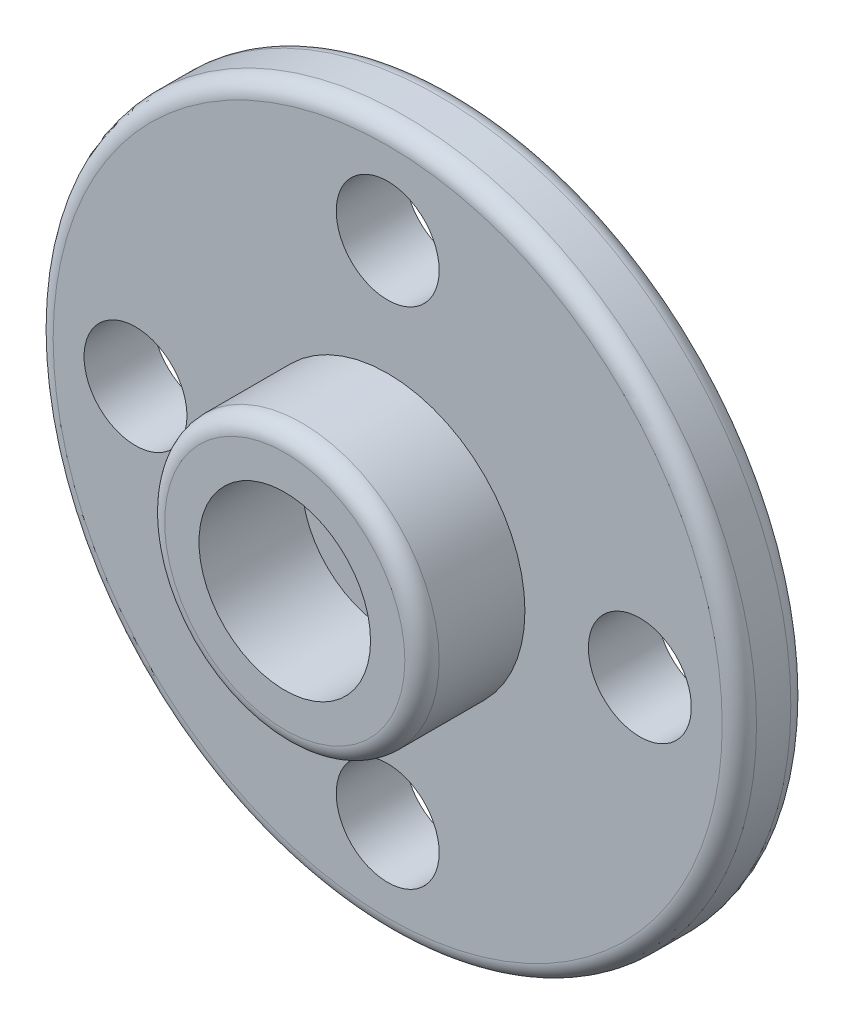
ISO-10303-21;
HEADER;
FILE_DESCRIPTION(('STEP AP214'),'2;1');
FILE_NAME('part.step','',(''),(''),'','','');
FILE_SCHEMA(('AUTOMOTIVE_DESIGN { 1 0 10303 214 1 1 1 1 }'));
ENDSEC;
DATA;
#1=APPLICATION_CONTEXT('core data for automotive mechanical design processes');
#2=APPLICATION_PROTOCOL_DEFINITION('international standard','automotive_design',2000,#1);
#3=PRODUCT_CONTEXT('',#1,'mechanical');
#4=PRODUCT('Part','Part','',(#3));
#5=PRODUCT_RELATED_PRODUCT_CATEGORY('part','',(#4));
#6=PRODUCT_DEFINITION_FORMATION('','',#4);
#7=PRODUCT_DEFINITION_CONTEXT('part definition',#1,'design');
#8=PRODUCT_DEFINITION('design','',#6,#7);
#9=PRODUCT_DEFINITION_SHAPE('','',#8);
#10=(LENGTH_UNIT() NAMED_UNIT(*) SI_UNIT(.MILLI.,.METRE.));
#11=(NAMED_UNIT(*) PLANE_ANGLE_UNIT() SI_UNIT($,.RADIAN.));
#12=(NAMED_UNIT(*) SI_UNIT($,.STERADIAN.) SOLID_ANGLE_UNIT());
#13=UNCERTAINTY_MEASURE_WITH_UNIT(LENGTH_MEASURE(1.E-05),#10,'distance_accuracy_value','');
#14=(GEOMETRIC_REPRESENTATION_CONTEXT(3) GLOBAL_UNCERTAINTY_ASSIGNED_CONTEXT((#13)) GLOBAL_UNIT_ASSIGNED_CONTEXT((#10,
#11,#12)) REPRESENTATION_CONTEXT('',''));
#15=CARTESIAN_POINT('',(0.,0.,0.));
#16=DIRECTION('',(0.,0.,1.));
#17=DIRECTION('',(1.,0.,0.));
#18=AXIS2_PLACEMENT_3D('',#15,#16,#17);
#19=CARTESIAN_POINT('',(0.,0.,4.5));
#20=DIRECTION('',(0.,0.,1.));
#21=DIRECTION('',(1.,0.,0.));
#22=AXIS2_PLACEMENT_3D('',#19,#20,#21);
#23=TOROIDAL_SURFACE('',#22,3.5,0.5);
#24=CARTESIAN_POINT('',(0.,0.,5.));
#25=DIRECTION('',(0.,0.,1.));
#26=DIRECTION('',(1.,0.,0.));
#27=AXIS2_PLACEMENT_3D('',#24,#25,#26);
#28=CIRCLE('',#27,3.5);
#29=CARTESIAN_POINT('',(3.5,0.,5.));
#30=VERTEX_POINT('',#29);
#31=EDGE_CURVE('E66',#30,#30,#28,.T.);
#32=ORIENTED_EDGE('',*,*,#31,.F.);
#33=EDGE_LOOP('',(#32));
#34=FACE_BOUND('',#33,.T.);
#35=CARTESIAN_POINT('',(0.,0.,4.5));
#36=DIRECTION('',(0.,0.,1.));
#37=DIRECTION('',(1.,0.,0.));
#38=AXIS2_PLACEMENT_3D('',#35,#36,#37);
#39=CIRCLE('',#38,4.);
#40=CARTESIAN_POINT('',(4.,0.,4.5));
#41=VERTEX_POINT('',#40);
#42=EDGE_CURVE('E11',#41,#41,#39,.F.);
#43=ORIENTED_EDGE('',*,*,#42,.F.);
#44=EDGE_LOOP('',(#43));
#45=FACE_BOUND('',#44,.T.);
#46=ADVANCED_FACE('F60',(#34,#45),#23,.T.);
#47=CARTESIAN_POINT('',(0.,0.,0.5));
#48=DIRECTION('',(0.,0.,1.));
#49=DIRECTION('',(1.,0.,0.));
#50=AXIS2_PLACEMENT_3D('',#47,#48,#49);
#51=TOROIDAL_SURFACE('',#50,9.75,0.5);
#52=CARTESIAN_POINT('',(0.,0.,0.));
#53=DIRECTION('',(0.,0.,1.));
#54=DIRECTION('',(1.,0.,0.));
#55=AXIS2_PLACEMENT_3D('',#52,#53,#54);
#56=CIRCLE('',#55,9.75);
#57=CARTESIAN_POINT('',(9.75,0.,0.));
#58=VERTEX_POINT('',#57);
#59=EDGE_CURVE('E74',#58,#58,#56,.F.);
#60=ORIENTED_EDGE('',*,*,#59,.F.);
#61=EDGE_LOOP('',(#60));
#62=FACE_BOUND('',#61,.T.);
#63=CARTESIAN_POINT('',(0.,0.,0.5));
#64=DIRECTION('',(0.,0.,1.));
#65=DIRECTION('',(1.,0.,0.));
#66=AXIS2_PLACEMENT_3D('',#63,#64,#65);
#67=CIRCLE('',#66,10.25);
#68=CARTESIAN_POINT('',(10.25,0.,0.5));
#69=VERTEX_POINT('',#68);
#70=EDGE_CURVE('E70',#69,#69,#67,.T.);
#71=ORIENTED_EDGE('',*,*,#70,.F.);
#72=EDGE_LOOP('',(#71));
#73=FACE_BOUND('',#72,.T.);
#74=ADVANCED_FACE('F143',(#62,#73),#51,.T.);
#75=CARTESIAN_POINT('',(0.,0.,1.5));
#76=DIRECTION('',(0.,0.,1.));
#77=DIRECTION('',(1.,0.,0.));
#78=AXIS2_PLACEMENT_3D('',#75,#76,#77);
#79=TOROIDAL_SURFACE('',#78,9.75,0.5);
#80=CARTESIAN_POINT('',(0.,0.,2.));
#81=DIRECTION('',(0.,0.,1.));
#82=DIRECTION('',(1.,0.,0.));
#83=AXIS2_PLACEMENT_3D('',#80,#81,#82);
#84=CIRCLE('',#83,9.75);
#85=CARTESIAN_POINT('',(9.75,0.,2.));
#86=VERTEX_POINT('',#85);
#87=EDGE_CURVE('E82',#86,#86,#84,.T.);
#88=ORIENTED_EDGE('',*,*,#87,.F.);
#89=EDGE_LOOP('',(#88));
#90=FACE_BOUND('',#89,.T.);
#91=CARTESIAN_POINT('',(0.,0.,1.5));
#92=DIRECTION('',(0.,0.,1.));
#93=DIRECTION('',(1.,0.,0.));
#94=AXIS2_PLACEMENT_3D('',#91,#92,#93);
#95=CIRCLE('',#94,10.25);
#96=CARTESIAN_POINT('',(10.25,0.,1.5));
#97=VERTEX_POINT('',#96);
#98=EDGE_CURVE('E79',#97,#97,#95,.F.);
#99=ORIENTED_EDGE('',*,*,#98,.F.);
#100=EDGE_LOOP('',(#99));
#101=FACE_BOUND('',#100,.T.);
#102=ADVANCED_FACE('F148',(#90,#101),#79,.T.);
#103=CARTESIAN_POINT('',(0.,0.,2.));
#104=DIRECTION('',(0.,0.,1.));
#105=DIRECTION('',(1.,0.,0.));
#106=AXIS2_PLACEMENT_3D('',#103,#104,#105);
#107=PLANE('',#106);
#108=ORIENTED_EDGE('',*,*,#87,.T.);
#109=EDGE_LOOP('',(#108));
#110=FACE_BOUND('',#109,.T.);
#111=CARTESIAN_POINT('',(7.35000000000001,0.,2.));
#112=DIRECTION('',(0.,0.,-1.));
#113=DIRECTION('',(-1.,0.,0.));
#114=AXIS2_PLACEMENT_3D('',#111,#112,#113);
#115=CIRCLE('',#114,1.5);
#116=CARTESIAN_POINT('',(5.85000000000001,0.,2.));
#117=VERTEX_POINT('',#116);
#118=EDGE_CURVE('E101',#117,#117,#115,.T.);
#119=ORIENTED_EDGE('',*,*,#118,.T.);
#120=EDGE_LOOP('',(#119));
#121=FACE_BOUND('',#120,.T.);
#122=CARTESIAN_POINT('',(-7.35,0.,2.));
#123=DIRECTION('',(0.,0.,1.));
#124=DIRECTION('',(1.,0.,0.));
#125=AXIS2_PLACEMENT_3D('',#122,#123,#124);
#126=CIRCLE('',#125,1.5);
#127=CARTESIAN_POINT('',(-5.85,0.,2.));
#128=VERTEX_POINT('',#127);
#129=EDGE_CURVE('E89',#128,#128,#126,.T.);
#130=ORIENTED_EDGE('',*,*,#129,.F.);
#131=EDGE_LOOP('',(#130));
#132=FACE_BOUND('',#131,.T.);
#133=CARTESIAN_POINT('',(0.,7.35,2.));
#134=DIRECTION('',(0.,0.,1.));
#135=DIRECTION('',(1.,0.,0.));
#136=AXIS2_PLACEMENT_3D('',#133,#134,#135);
#137=CIRCLE('',#136,1.5);
#138=CARTESIAN_POINT('',(1.5,7.35,2.));
#139=VERTEX_POINT('',#138);
#140=EDGE_CURVE('E85',#139,#139,#137,.T.);
#141=ORIENTED_EDGE('',*,*,#140,.F.);
#142=EDGE_LOOP('',(#141));
#143=FACE_BOUND('',#142,.T.);
#144=CARTESIAN_POINT('',(0.,-7.35,2.));
#145=DIRECTION('',(0.,0.,1.));
#146=DIRECTION('',(1.,0.,0.));
#147=AXIS2_PLACEMENT_3D('',#144,#145,#146);
#148=CIRCLE('',#147,1.5);
#149=CARTESIAN_POINT('',(1.5,-7.35,2.));
#150=VERTEX_POINT('',#149);
#151=EDGE_CURVE('E95',#150,#150,#148,.T.);
#152=ORIENTED_EDGE('',*,*,#151,.F.);
#153=EDGE_LOOP('',(#152));
#154=FACE_BOUND('',#153,.T.);
#155=CARTESIAN_POINT('',(0.,0.,2.));
#156=DIRECTION('',(0.,0.,1.));
#157=DIRECTION('',(1.,0.,0.));
#158=AXIS2_PLACEMENT_3D('',#155,#156,#157);
#159=CIRCLE('',#158,4.);
#160=CARTESIAN_POINT('',(4.,0.,2.));
#161=VERTEX_POINT('',#160);
#162=EDGE_CURVE('E112',#161,#161,#159,.T.);
#163=ORIENTED_EDGE('',*,*,#162,.F.);
#164=EDGE_LOOP('',(#163));
#165=FACE_BOUND('',#164,.T.);
#166=ADVANCED_FACE('F154',(#110,#121,#132,#143,#154,#165),#107,.T.);
#167=CARTESIAN_POINT('',(0.,0.,0.));
#168=DIRECTION('',(0.,0.,1.));
#169=DIRECTION('',(1.,0.,0.));
#170=AXIS2_PLACEMENT_3D('',#167,#168,#169);
#171=PLANE('',#170);
#172=ORIENTED_EDGE('',*,*,#59,.T.);
#173=EDGE_LOOP('',(#172));
#174=FACE_BOUND('',#173,.T.);
#175=CARTESIAN_POINT('',(0.,-7.35,0.));
#176=DIRECTION('',(0.,0.,1.));
#177=DIRECTION('',(1.,0.,0.));
#178=AXIS2_PLACEMENT_3D('',#175,#176,#177);
#179=CIRCLE('',#178,1.5);
#180=CARTESIAN_POINT('',(1.5,-7.35,0.));
#181=VERTEX_POINT('',#180);
#182=EDGE_CURVE('E98',#181,#181,#179,.T.);
#183=ORIENTED_EDGE('',*,*,#182,.T.);
#184=EDGE_LOOP('',(#183));
#185=FACE_BOUND('',#184,.T.);
#186=CARTESIAN_POINT('',(0.,7.35,0.));
#187=DIRECTION('',(0.,0.,1.));
#188=DIRECTION('',(1.,0.,0.));
#189=AXIS2_PLACEMENT_3D('',#186,#187,#188);
#190=CIRCLE('',#189,1.5);
#191=CARTESIAN_POINT('',(1.5,7.35,0.));
#192=VERTEX_POINT('',#191);
#193=EDGE_CURVE('E86',#192,#192,#190,.T.);
#194=ORIENTED_EDGE('',*,*,#193,.T.);
#195=EDGE_LOOP('',(#194));
#196=FACE_BOUND('',#195,.T.);
#197=CARTESIAN_POINT('',(-7.35,0.,0.));
#198=DIRECTION('',(0.,0.,1.));
#199=DIRECTION('',(1.,0.,0.));
#200=AXIS2_PLACEMENT_3D('',#197,#198,#199);
#201=CIRCLE('',#200,1.5);
#202=CARTESIAN_POINT('',(-5.85,0.,0.));
#203=VERTEX_POINT('',#202);
#204=EDGE_CURVE('E92',#203,#203,#201,.T.);
#205=ORIENTED_EDGE('',*,*,#204,.T.);
#206=EDGE_LOOP('',(#205));
#207=FACE_BOUND('',#206,.T.);
#208=CARTESIAN_POINT('',(7.35000000000001,0.,0.));
#209=DIRECTION('',(0.,0.,-1.));
#210=DIRECTION('',(-1.,0.,0.));
#211=AXIS2_PLACEMENT_3D('',#208,#209,#210);
#212=CIRCLE('',#211,1.5);
#213=CARTESIAN_POINT('',(5.85000000000001,0.,0.));
#214=VERTEX_POINT('',#213);
#215=EDGE_CURVE('E104',#214,#214,#212,.T.);
#216=ORIENTED_EDGE('',*,*,#215,.F.);
#217=EDGE_LOOP('',(#216));
#218=FACE_BOUND('',#217,.T.);
#219=CARTESIAN_POINT('',(0.,0.,0.));
#220=DIRECTION('',(0.,0.,1.));
#221=DIRECTION('',(1.,0.,0.));
#222=AXIS2_PLACEMENT_3D('',#219,#220,#221);
#223=CIRCLE('',#222,1.5);
#224=CARTESIAN_POINT('',(1.5,0.,0.));
#225=VERTEX_POINT('',#224);
#226=EDGE_CURVE('E107',#225,#225,#223,.T.);
#227=ORIENTED_EDGE('',*,*,#226,.T.);
#228=EDGE_LOOP('',(#227));
#229=FACE_BOUND('',#228,.T.);
#230=ADVANCED_FACE('F164',(#174,#185,#196,#207,#218,#229),#171,.F.);
#231=CARTESIAN_POINT('',(0.,0.,2.));
#232=DIRECTION('',(0.,0.,-1.));
#233=DIRECTION('',(-1.,0.,0.));
#234=AXIS2_PLACEMENT_3D('',#231,#232,#233);
#235=CYLINDRICAL_SURFACE('',#234,10.25);
#236=ORIENTED_EDGE('',*,*,#70,.T.);
#237=EDGE_LOOP('',(#236));
#238=FACE_BOUND('',#237,.T.);
#239=ORIENTED_EDGE('',*,*,#98,.T.);
#240=EDGE_LOOP('',(#239));
#241=FACE_BOUND('',#240,.T.);
#242=ADVANCED_FACE('F160',(#238,#241),#235,.T.);
#243=CARTESIAN_POINT('',(0.,7.35,2.));
#244=DIRECTION('',(0.,0.,-1.));
#245=DIRECTION('',(-1.,0.,0.));
#246=AXIS2_PLACEMENT_3D('',#243,#244,#245);
#247=CYLINDRICAL_SURFACE('',#246,1.5);
#248=ORIENTED_EDGE('',*,*,#140,.T.);
#249=EDGE_LOOP('',(#248));
#250=FACE_BOUND('',#249,.T.);
#251=ORIENTED_EDGE('',*,*,#193,.F.);
#252=EDGE_LOOP('',(#251));
#253=FACE_BOUND('',#252,.T.);
#254=ADVANCED_FACE('F163',(#250,#253),#247,.F.);
#255=CARTESIAN_POINT('',(-7.35,0.,2.));
#256=DIRECTION('',(0.,0.,-1.));
#257=DIRECTION('',(-1.,0.,0.));
#258=AXIS2_PLACEMENT_3D('',#255,#256,#257);
#259=CYLINDRICAL_SURFACE('',#258,1.5);
#260=ORIENTED_EDGE('',*,*,#129,.T.);
#261=EDGE_LOOP('',(#260));
#262=FACE_BOUND('',#261,.T.);
#263=ORIENTED_EDGE('',*,*,#204,.F.);
#264=EDGE_LOOP('',(#263));
#265=FACE_BOUND('',#264,.T.);
#266=ADVANCED_FACE('F174',(#262,#265),#259,.F.);
#267=CARTESIAN_POINT('',(0.,-7.35,2.));
#268=DIRECTION('',(0.,0.,-1.));
#269=DIRECTION('',(-1.,0.,0.));
#270=AXIS2_PLACEMENT_3D('',#267,#268,#269);
#271=CYLINDRICAL_SURFACE('',#270,1.5);
#272=ORIENTED_EDGE('',*,*,#151,.T.);
#273=EDGE_LOOP('',(#272));
#274=FACE_BOUND('',#273,.T.);
#275=ORIENTED_EDGE('',*,*,#182,.F.);
#276=EDGE_LOOP('',(#275));
#277=FACE_BOUND('',#276,.T.);
#278=ADVANCED_FACE('F178',(#274,#277),#271,.F.);
#279=CARTESIAN_POINT('',(7.35000000000001,0.,2.));
#280=DIRECTION('',(0.,0.,-1.));
#281=DIRECTION('',(-1.,0.,0.));
#282=AXIS2_PLACEMENT_3D('',#279,#280,#281);
#283=CYLINDRICAL_SURFACE('',#282,1.5);
#284=ORIENTED_EDGE('',*,*,#118,.F.);
#285=EDGE_LOOP('',(#284));
#286=FACE_BOUND('',#285,.T.);
#287=ORIENTED_EDGE('',*,*,#215,.T.);
#288=EDGE_LOOP('',(#287));
#289=FACE_BOUND('',#288,.T.);
#290=ADVANCED_FACE('F182',(#286,#289),#283,.F.);
#291=CARTESIAN_POINT('',(0.,0.,2.));
#292=DIRECTION('',(0.,0.,-1.));
#293=DIRECTION('',(-1.,0.,0.));
#294=AXIS2_PLACEMENT_3D('',#291,#292,#293);
#295=CYLINDRICAL_SURFACE('',#294,1.5);
#296=CARTESIAN_POINT('',(0.,0.,2.));
#297=DIRECTION('',(0.,0.,1.));
#298=DIRECTION('',(1.,0.,0.));
#299=AXIS2_PLACEMENT_3D('',#296,#297,#298);
#300=CIRCLE('',#299,1.5);
#301=CARTESIAN_POINT('',(1.5,0.,2.));
#302=VERTEX_POINT('',#301);
#303=EDGE_CURVE('E115',#302,#302,#300,.T.);
#304=ORIENTED_EDGE('',*,*,#303,.T.);
#305=EDGE_LOOP('',(#304));
#306=FACE_BOUND('',#305,.T.);
#307=ORIENTED_EDGE('',*,*,#226,.F.);
#308=EDGE_LOOP('',(#307));
#309=FACE_BOUND('',#308,.T.);
#310=ADVANCED_FACE('F140',(#306,#309),#295,.F.);
#311=CARTESIAN_POINT('',(0.,0.,5.));
#312=DIRECTION('',(0.,0.,-1.));
#313=DIRECTION('',(-1.,0.,0.));
#314=AXIS2_PLACEMENT_3D('',#311,#312,#313);
#315=CYLINDRICAL_SURFACE('',#314,4.);
#316=ORIENTED_EDGE('',*,*,#42,.T.);
#317=EDGE_LOOP('',(#316));
#318=FACE_BOUND('',#317,.T.);
#319=ORIENTED_EDGE('',*,*,#162,.T.);
#320=EDGE_LOOP('',(#319));
#321=FACE_BOUND('',#320,.T.);
#322=ADVANCED_FACE('F135',(#318,#321),#315,.T.);
#323=CARTESIAN_POINT('',(0.,0.,5.));
#324=DIRECTION('',(0.,0.,1.));
#325=DIRECTION('',(1.,0.,0.));
#326=AXIS2_PLACEMENT_3D('',#323,#324,#325);
#327=PLANE('',#326);
#328=ORIENTED_EDGE('',*,*,#31,.T.);
#329=EDGE_LOOP('',(#328));
#330=FACE_BOUND('',#329,.T.);
#331=CARTESIAN_POINT('',(0.,0.,5.));
#332=DIRECTION('',(0.,0.,1.));
#333=DIRECTION('',(1.,0.,0.));
#334=AXIS2_PLACEMENT_3D('',#331,#332,#333);
#335=CIRCLE('',#334,2.5);
#336=CARTESIAN_POINT('',(2.5,0.,5.));
#337=VERTEX_POINT('',#336);
#338=EDGE_CURVE('E119',#337,#337,#335,.T.);
#339=ORIENTED_EDGE('',*,*,#338,.F.);
#340=EDGE_LOOP('',(#339));
#341=FACE_BOUND('',#340,.T.);
#342=ADVANCED_FACE('F130',(#330,#341),#327,.T.);
#343=CARTESIAN_POINT('',(0.,0.,2.));
#344=DIRECTION('',(0.,0.,1.));
#345=DIRECTION('',(1.,0.,0.));
#346=AXIS2_PLACEMENT_3D('',#343,#344,#345);
#347=CYLINDRICAL_SURFACE('',#346,2.5);
#348=CARTESIAN_POINT('',(0.,0.,2.));
#349=DIRECTION('',(0.,0.,1.));
#350=DIRECTION('',(1.,0.,0.));
#351=AXIS2_PLACEMENT_3D('',#348,#349,#350);
#352=CIRCLE('',#351,2.5);
#353=CARTESIAN_POINT('',(2.5,0.,2.));
#354=VERTEX_POINT('',#353);
#355=EDGE_CURVE('E118',#354,#354,#352,.T.);
#356=ORIENTED_EDGE('',*,*,#355,.F.);
#357=EDGE_LOOP('',(#356));
#358=FACE_BOUND('',#357,.T.);
#359=ORIENTED_EDGE('',*,*,#338,.T.);
#360=EDGE_LOOP('',(#359));
#361=FACE_BOUND('',#360,.T.);
#362=ADVANCED_FACE('F127',(#358,#361),#347,.F.);
#363=CARTESIAN_POINT('',(0.,0.,2.));
#364=DIRECTION('',(0.,0.,1.));
#365=DIRECTION('',(1.,0.,0.));
#366=AXIS2_PLACEMENT_3D('',#363,#364,#365);
#367=PLANE('',#366);
#368=ORIENTED_EDGE('',*,*,#303,.F.);
#369=EDGE_LOOP('',(#368));
#370=FACE_BOUND('',#369,.T.);
#371=ORIENTED_EDGE('',*,*,#355,.T.);
#372=EDGE_LOOP('',(#371));
#373=FACE_BOUND('',#372,.T.);
#374=ADVANCED_FACE('F125',(#370,#373),#367,.T.);
#375=CLOSED_SHELL('',(#46,#74,#102,#166,#230,#242,#254,#266,#278,#290,#310,#322,#342,#362,#374));
#376=MANIFOLD_SOLID_BREP('B2',#375);
#377=ADVANCED_BREP_SHAPE_REPRESENTATION('',(#18,#376),#14);
#378=SHAPE_DEFINITION_REPRESENTATION(#9,#377);
ENDSEC;
END-ISO-10303-21;
